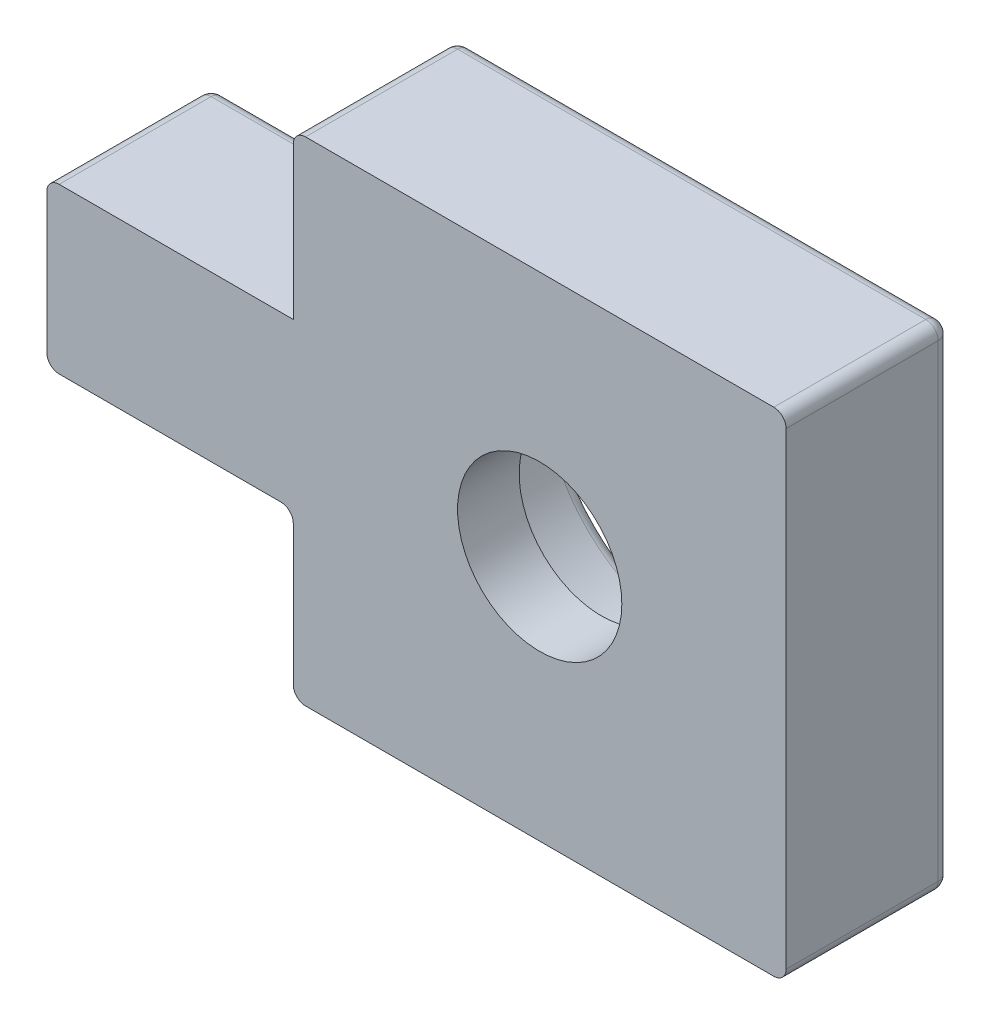
ISO-10303-21;
HEADER;
FILE_DESCRIPTION(('STEP AP214'),'2;1');
FILE_NAME('part.step','',(''),(''),'','','');
FILE_SCHEMA(('AUTOMOTIVE_DESIGN { 1 0 10303 214 1 1 1 1 }'));
ENDSEC;
DATA;
#1=APPLICATION_CONTEXT('core data for automotive mechanical design processes');
#2=APPLICATION_PROTOCOL_DEFINITION('international standard','automotive_design',2000,#1);
#3=PRODUCT_CONTEXT('',#1,'mechanical');
#4=PRODUCT('Part','Part','',(#3));
#5=PRODUCT_RELATED_PRODUCT_CATEGORY('part','',(#4));
#6=PRODUCT_DEFINITION_FORMATION('','',#4);
#7=PRODUCT_DEFINITION_CONTEXT('part definition',#1,'design');
#8=PRODUCT_DEFINITION('design','',#6,#7);
#9=PRODUCT_DEFINITION_SHAPE('','',#8);
#10=(LENGTH_UNIT() NAMED_UNIT(*) SI_UNIT(.MILLI.,.METRE.));
#11=(NAMED_UNIT(*) PLANE_ANGLE_UNIT() SI_UNIT($,.RADIAN.));
#12=(NAMED_UNIT(*) SI_UNIT($,.STERADIAN.) SOLID_ANGLE_UNIT());
#13=UNCERTAINTY_MEASURE_WITH_UNIT(LENGTH_MEASURE(1.E-05),#10,'distance_accuracy_value','');
#14=(GEOMETRIC_REPRESENTATION_CONTEXT(3) GLOBAL_UNCERTAINTY_ASSIGNED_CONTEXT((#13)) GLOBAL_UNIT_ASSIGNED_CONTEXT((#10,
#11,#12)) REPRESENTATION_CONTEXT('',''));
#15=CARTESIAN_POINT('',(0.,0.,0.));
#16=DIRECTION('',(0.,0.,1.));
#17=DIRECTION('',(1.,0.,0.));
#18=AXIS2_PLACEMENT_3D('',#15,#16,#17);
#19=CARTESIAN_POINT('',(0.,0.,4.));
#20=DIRECTION('',(1.,0.,0.));
#21=DIRECTION('',(0.,0.,-1.));
#22=AXIS2_PLACEMENT_3D('',#19,#20,#21);
#23=PLANE('',#22);
#24=DIRECTION('',(0.,0.,-1.));
#25=VECTOR('',#24,1.);
#26=CARTESIAN_POINT('',(0.,11.7,4.));
#27=LINE('',#26,#25);
#28=CARTESIAN_POINT('',(0.,11.7,4.));
#29=VERTEX_POINT('',#28);
#30=CARTESIAN_POINT('',(0.,11.7,0.3));
#31=VERTEX_POINT('',#30);
#32=EDGE_CURVE('E57',#29,#31,#27,.T.);
#33=ORIENTED_EDGE('',*,*,#32,.T.);
#34=DIRECTION('',(0.,-1.,0.));
#35=VECTOR('',#34,1.);
#36=CARTESIAN_POINT('',(0.,8.,0.3));
#37=LINE('',#36,#35);
#38=CARTESIAN_POINT('',(0.,8.,0.3));
#39=VERTEX_POINT('',#38);
#40=EDGE_CURVE('E196',#31,#39,#37,.T.);
#41=ORIENTED_EDGE('',*,*,#40,.T.);
#42=DIRECTION('',(0.,0.,-1.));
#43=VECTOR('',#42,1.);
#44=CARTESIAN_POINT('',(0.,8.,4.));
#45=LINE('',#44,#43);
#46=CARTESIAN_POINT('',(0.,8.,4.));
#47=VERTEX_POINT('',#46);
#48=EDGE_CURVE('E188',#47,#39,#45,.T.);
#49=ORIENTED_EDGE('',*,*,#48,.F.);
#50=DIRECTION('',(0.,-1.,0.));
#51=VECTOR('',#50,1.);
#52=CARTESIAN_POINT('',(0.,0.,4.));
#53=LINE('',#52,#51);
#54=EDGE_CURVE('E174',#29,#47,#53,.T.);
#55=ORIENTED_EDGE('',*,*,#54,.F.);
#56=EDGE_LOOP('',(#33,#41,#49,#55));
#57=FACE_BOUND('',#56,.T.);
#58=ADVANCED_FACE('F39',(#57),#23,.F.);
#59=CARTESIAN_POINT('',(0.,3.7,4.));
#60=VERTEX_POINT('',#59);
#61=CARTESIAN_POINT('',(0.,0.3,4.));
#62=VERTEX_POINT('',#61);
#63=EDGE_CURVE('E182',#60,#62,#53,.T.);
#64=ORIENTED_EDGE('',*,*,#63,.F.);
#65=DIRECTION('',(0.,0.,-1.));
#66=VECTOR('',#65,1.);
#67=CARTESIAN_POINT('',(0.,3.7,0.));
#68=LINE('',#67,#66);
#69=CARTESIAN_POINT('',(0.,3.7,0.3));
#70=VERTEX_POINT('',#69);
#71=EDGE_CURVE('E301',#60,#70,#68,.T.);
#72=ORIENTED_EDGE('',*,*,#71,.T.);
#73=DIRECTION('',(0.,-1.,0.));
#74=VECTOR('',#73,1.);
#75=CARTESIAN_POINT('',(0.,0.,0.3));
#76=LINE('',#75,#74);
#77=CARTESIAN_POINT('',(0.,0.3,0.3));
#78=VERTEX_POINT('',#77);
#79=EDGE_CURVE('E298',#70,#78,#76,.T.);
#80=ORIENTED_EDGE('',*,*,#79,.T.);
#81=DIRECTION('',(0.,0.,-1.));
#82=VECTOR('',#81,1.);
#83=CARTESIAN_POINT('',(0.,0.3,4.));
#84=LINE('',#83,#82);
#85=EDGE_CURVE('E295',#78,#62,#84,.F.);
#86=ORIENTED_EDGE('',*,*,#85,.T.);
#87=EDGE_LOOP('',(#64,#72,#80,#86));
#88=FACE_BOUND('',#87,.T.);
#89=ADVANCED_FACE('F562',(#88),#23,.F.);
#90=CARTESIAN_POINT('',(0.,0.,4.));
#91=DIRECTION('',(0.,1.,0.));
#92=DIRECTION('',(0.,0.,1.));
#93=AXIS2_PLACEMENT_3D('',#90,#91,#92);
#94=PLANE('',#93);
#95=DIRECTION('',(1.,0.,0.));
#96=VECTOR('',#95,1.);
#97=CARTESIAN_POINT('',(12.,0.,0.3));
#98=LINE('',#97,#96);
#99=CARTESIAN_POINT('',(0.3,0.,0.3));
#100=VERTEX_POINT('',#99);
#101=CARTESIAN_POINT('',(11.7,0.,0.3));
#102=VERTEX_POINT('',#101);
#103=EDGE_CURVE('E307',#100,#102,#98,.T.);
#104=ORIENTED_EDGE('',*,*,#103,.T.);
#105=DIRECTION('',(0.,0.,-1.));
#106=VECTOR('',#105,1.);
#107=CARTESIAN_POINT('',(11.7,0.,4.));
#108=LINE('',#107,#106);
#109=CARTESIAN_POINT('',(11.7,0.,4.));
#110=VERTEX_POINT('',#109);
#111=EDGE_CURVE('E310',#102,#110,#108,.F.);
#112=ORIENTED_EDGE('',*,*,#111,.T.);
#113=DIRECTION('',(1.,0.,0.));
#114=VECTOR('',#113,1.);
#115=CARTESIAN_POINT('',(0.,0.,4.));
#116=LINE('',#115,#114);
#117=CARTESIAN_POINT('',(0.3,0.,4.));
#118=VERTEX_POINT('',#117);
#119=EDGE_CURVE('E181',#118,#110,#116,.T.);
#120=ORIENTED_EDGE('',*,*,#119,.F.);
#121=DIRECTION('',(0.,0.,-1.));
#122=VECTOR('',#121,1.);
#123=CARTESIAN_POINT('',(0.3,0.,4.));
#124=LINE('',#123,#122);
#125=EDGE_CURVE('E304',#118,#100,#124,.T.);
#126=ORIENTED_EDGE('',*,*,#125,.T.);
#127=EDGE_LOOP('',(#104,#112,#120,#126));
#128=FACE_BOUND('',#127,.T.);
#129=ADVANCED_FACE('F467',(#128),#94,.F.);
#130=CARTESIAN_POINT('',(12.,0.,4.));
#131=DIRECTION('',(-1.,0.,0.));
#132=DIRECTION('',(0.,0.,1.));
#133=AXIS2_PLACEMENT_3D('',#130,#131,#132);
#134=PLANE('',#133);
#135=DIRECTION('',(0.,1.,0.));
#136=VECTOR('',#135,1.);
#137=CARTESIAN_POINT('',(12.,12.,0.3));
#138=LINE('',#137,#136);
#139=CARTESIAN_POINT('',(12.,0.3,0.3));
#140=VERTEX_POINT('',#139);
#141=CARTESIAN_POINT('',(12.,11.7,0.3));
#142=VERTEX_POINT('',#141);
#143=EDGE_CURVE('E316',#140,#142,#138,.T.);
#144=ORIENTED_EDGE('',*,*,#143,.T.);
#145=DIRECTION('',(0.,0.,-1.));
#146=VECTOR('',#145,1.);
#147=CARTESIAN_POINT('',(12.,11.7,4.));
#148=LINE('',#147,#146);
#149=CARTESIAN_POINT('',(12.,11.7,4.));
#150=VERTEX_POINT('',#149);
#151=EDGE_CURVE('E319',#142,#150,#148,.F.);
#152=ORIENTED_EDGE('',*,*,#151,.T.);
#153=DIRECTION('',(0.,1.,0.));
#154=VECTOR('',#153,1.);
#155=CARTESIAN_POINT('',(12.,0.,4.));
#156=LINE('',#155,#154);
#157=CARTESIAN_POINT('',(12.,0.3,4.));
#158=VERTEX_POINT('',#157);
#159=EDGE_CURVE('E217',#158,#150,#156,.T.);
#160=ORIENTED_EDGE('',*,*,#159,.F.);
#161=DIRECTION('',(0.,0.,-1.));
#162=VECTOR('',#161,1.);
#163=CARTESIAN_POINT('',(12.,0.3,4.));
#164=LINE('',#163,#162);
#165=EDGE_CURVE('E313',#158,#140,#164,.T.);
#166=ORIENTED_EDGE('',*,*,#165,.T.);
#167=EDGE_LOOP('',(#144,#152,#160,#166));
#168=FACE_BOUND('',#167,.T.);
#169=ADVANCED_FACE('F478',(#168),#134,.F.);
#170=CARTESIAN_POINT('',(0.,12.,4.));
#171=DIRECTION('',(0.,-1.,0.));
#172=DIRECTION('',(0.,0.,-1.));
#173=AXIS2_PLACEMENT_3D('',#170,#171,#172);
#174=PLANE('',#173);
#175=DIRECTION('',(-1.,0.,0.));
#176=VECTOR('',#175,1.);
#177=CARTESIAN_POINT('',(0.,12.,0.3));
#178=LINE('',#177,#176);
#179=CARTESIAN_POINT('',(11.7,12.,0.3));
#180=VERTEX_POINT('',#179);
#181=CARTESIAN_POINT('',(0.3,12.,0.3));
#182=VERTEX_POINT('',#181);
#183=EDGE_CURVE('E325',#180,#182,#178,.T.);
#184=ORIENTED_EDGE('',*,*,#183,.T.);
#185=DIRECTION('',(0.,0.,-1.));
#186=VECTOR('',#185,1.);
#187=CARTESIAN_POINT('',(0.3,12.,4.));
#188=LINE('',#187,#186);
#189=CARTESIAN_POINT('',(0.3,12.,4.));
#190=VERTEX_POINT('',#189);
#191=EDGE_CURVE('E328',#182,#190,#188,.F.);
#192=ORIENTED_EDGE('',*,*,#191,.T.);
#193=DIRECTION('',(-1.,0.,0.));
#194=VECTOR('',#193,1.);
#195=CARTESIAN_POINT('',(0.,12.,4.));
#196=LINE('',#195,#194);
#197=CARTESIAN_POINT('',(11.7,12.,4.));
#198=VERTEX_POINT('',#197);
#199=EDGE_CURVE('E221',#198,#190,#196,.T.);
#200=ORIENTED_EDGE('',*,*,#199,.F.);
#201=DIRECTION('',(0.,0.,-1.));
#202=VECTOR('',#201,1.);
#203=CARTESIAN_POINT('',(11.7,12.,4.));
#204=LINE('',#203,#202);
#205=EDGE_CURVE('E322',#198,#180,#204,.T.);
#206=ORIENTED_EDGE('',*,*,#205,.T.);
#207=EDGE_LOOP('',(#184,#192,#200,#206));
#208=FACE_BOUND('',#207,.T.);
#209=ADVANCED_FACE('F498',(#208),#174,.F.);
#210=CARTESIAN_POINT('',(0.,0.,4.));
#211=DIRECTION('',(0.,0.,-1.));
#212=DIRECTION('',(-1.,0.,0.));
#213=AXIS2_PLACEMENT_3D('',#210,#211,#212);
#214=PLANE('',#213);
#215=CARTESIAN_POINT('',(6.,6.,4.));
#216=DIRECTION('',(0.,0.,1.));
#217=DIRECTION('',(1.,0.,0.));
#218=AXIS2_PLACEMENT_3D('',#215,#216,#217);
#219=CIRCLE('',#218,2.);
#220=CARTESIAN_POINT('',(8.,6.,4.));
#221=VERTEX_POINT('',#220);
#222=EDGE_CURVE('E210',#221,#221,#219,.T.);
#223=ORIENTED_EDGE('',*,*,#222,.F.);
#224=EDGE_LOOP('',(#223));
#225=FACE_BOUND('',#224,.T.);
#226=DIRECTION('',(-1.,0.,0.));
#227=VECTOR('',#226,1.);
#228=CARTESIAN_POINT('',(0.,8.,4.));
#229=LINE('',#228,#227);
#230=CARTESIAN_POINT('',(-5.7,8.,4.));
#231=VERTEX_POINT('',#230);
#232=EDGE_CURVE('E177',#47,#231,#229,.T.);
#233=ORIENTED_EDGE('',*,*,#232,.T.);
#234=CARTESIAN_POINT('',(-5.7,7.7,4.));
#235=DIRECTION('',(0.,0.,-1.));
#236=DIRECTION('',(-1.,0.,0.));
#237=AXIS2_PLACEMENT_3D('',#234,#235,#236);
#238=CIRCLE('',#237,0.3);
#239=CARTESIAN_POINT('',(-6.,7.7,4.));
#240=VERTEX_POINT('',#239);
#241=EDGE_CURVE('E49',#231,#240,#238,.F.);
#242=ORIENTED_EDGE('',*,*,#241,.T.);
#243=DIRECTION('',(0.,-1.,0.));
#244=VECTOR('',#243,1.);
#245=CARTESIAN_POINT('',(-6.,8.,4.));
#246=LINE('',#245,#244);
#247=CARTESIAN_POINT('',(-6.,4.3,4.));
#248=VERTEX_POINT('',#247);
#249=EDGE_CURVE('E193',#240,#248,#246,.T.);
#250=ORIENTED_EDGE('',*,*,#249,.T.);
#251=CARTESIAN_POINT('',(-5.7,4.3,4.));
#252=DIRECTION('',(0.,0.,-1.));
#253=DIRECTION('',(-1.,0.,0.));
#254=AXIS2_PLACEMENT_3D('',#251,#252,#253);
#255=CIRCLE('',#254,0.3);
#256=CARTESIAN_POINT('',(-5.7,4.,4.));
#257=VERTEX_POINT('',#256);
#258=EDGE_CURVE('E346',#248,#257,#255,.F.);
#259=ORIENTED_EDGE('',*,*,#258,.T.);
#260=DIRECTION('',(1.,0.,0.));
#261=VECTOR('',#260,1.);
#262=CARTESIAN_POINT('',(0.,4.,4.));
#263=LINE('',#262,#261);
#264=CARTESIAN_POINT('',(-0.3,4.,4.));
#265=VERTEX_POINT('',#264);
#266=EDGE_CURVE('E199',#257,#265,#263,.T.);
#267=ORIENTED_EDGE('',*,*,#266,.T.);
#268=CARTESIAN_POINT('',(-0.3,3.7,4.));
#269=DIRECTION('',(0.,0.,-1.));
#270=DIRECTION('',(-1.,0.,0.));
#271=AXIS2_PLACEMENT_3D('',#268,#269,#270);
#272=CIRCLE('',#271,0.3);
#273=EDGE_CURVE('E11',#265,#60,#272,.T.);
#274=ORIENTED_EDGE('',*,*,#273,.T.);
#275=ORIENTED_EDGE('',*,*,#63,.T.);
#276=CARTESIAN_POINT('',(0.3,0.3,4.));
#277=DIRECTION('',(0.,0.,-1.));
#278=DIRECTION('',(-1.,0.,0.));
#279=AXIS2_PLACEMENT_3D('',#276,#277,#278);
#280=CIRCLE('',#279,0.3);
#281=EDGE_CURVE('E343',#62,#118,#280,.F.);
#282=ORIENTED_EDGE('',*,*,#281,.T.);
#283=ORIENTED_EDGE('',*,*,#119,.T.);
#284=CARTESIAN_POINT('',(11.7,0.3,4.));
#285=DIRECTION('',(0.,0.,-1.));
#286=DIRECTION('',(-1.,0.,0.));
#287=AXIS2_PLACEMENT_3D('',#284,#285,#286);
#288=CIRCLE('',#287,0.3);
#289=EDGE_CURVE('E349',#110,#158,#288,.F.);
#290=ORIENTED_EDGE('',*,*,#289,.T.);
#291=ORIENTED_EDGE('',*,*,#159,.T.);
#292=CARTESIAN_POINT('',(11.7,11.7,4.));
#293=DIRECTION('',(0.,0.,-1.));
#294=DIRECTION('',(-1.,0.,0.));
#295=AXIS2_PLACEMENT_3D('',#292,#293,#294);
#296=CIRCLE('',#295,0.3);
#297=EDGE_CURVE('E352',#150,#198,#296,.F.);
#298=ORIENTED_EDGE('',*,*,#297,.T.);
#299=ORIENTED_EDGE('',*,*,#199,.T.);
#300=CARTESIAN_POINT('',(0.3,11.7,4.));
#301=DIRECTION('',(0.,0.,-1.));
#302=DIRECTION('',(-1.,0.,0.));
#303=AXIS2_PLACEMENT_3D('',#300,#301,#302);
#304=CIRCLE('',#303,0.3);
#305=EDGE_CURVE('E65',#190,#29,#304,.F.);
#306=ORIENTED_EDGE('',*,*,#305,.T.);
#307=ORIENTED_EDGE('',*,*,#54,.T.);
#308=EDGE_LOOP('',(#233,#242,#250,#259,#267,#274,#275,#282,#283,#290,#291,#298,#299,#306,#307));
#309=FACE_BOUND('',#308,.T.);
#310=ADVANCED_FACE('F176',(#225,#309),#214,.F.);
#311=CARTESIAN_POINT('',(0.,0.,0.));
#312=DIRECTION('',(0.,0.,-1.));
#313=DIRECTION('',(-1.,0.,0.));
#314=AXIS2_PLACEMENT_3D('',#311,#312,#313);
#315=PLANE('',#314);
#316=DIRECTION('',(1.,0.,0.));
#317=VECTOR('',#316,1.);
#318=CARTESIAN_POINT('',(-6.,4.3,0.));
#319=LINE('',#318,#317);
#320=CARTESIAN_POINT('',(-0.3,4.3,0.));
#321=VERTEX_POINT('',#320);
#322=CARTESIAN_POINT('',(-5.7,4.3,0.));
#323=VERTEX_POINT('',#322);
#324=EDGE_CURVE('E271',#321,#323,#319,.F.);
#325=ORIENTED_EDGE('',*,*,#324,.T.);
#326=DIRECTION('',(0.,-1.,0.));
#327=VECTOR('',#326,1.);
#328=CARTESIAN_POINT('',(-5.7,8.,0.));
#329=LINE('',#328,#327);
#330=CARTESIAN_POINT('',(-5.7,7.7,0.));
#331=VERTEX_POINT('',#330);
#332=EDGE_CURVE('E274',#323,#331,#329,.F.);
#333=ORIENTED_EDGE('',*,*,#332,.T.);
#334=DIRECTION('',(-1.,0.,0.));
#335=VECTOR('',#334,1.);
#336=CARTESIAN_POINT('',(0.,7.7,0.));
#337=LINE('',#336,#335);
#338=CARTESIAN_POINT('',(0.3,7.7,0.));
#339=VERTEX_POINT('',#338);
#340=EDGE_CURVE('E263',#331,#339,#337,.F.);
#341=ORIENTED_EDGE('',*,*,#340,.T.);
#342=DIRECTION('',(0.,-1.,0.));
#343=VECTOR('',#342,1.);
#344=CARTESIAN_POINT('',(0.3,12.,0.));
#345=LINE('',#344,#343);
#346=CARTESIAN_POINT('',(0.3,11.7,0.));
#347=VERTEX_POINT('',#346);
#348=EDGE_CURVE('E248',#339,#347,#345,.F.);
#349=ORIENTED_EDGE('',*,*,#348,.T.);
#350=DIRECTION('',(-1.,0.,0.));
#351=VECTOR('',#350,1.);
#352=CARTESIAN_POINT('',(12.,11.7,0.));
#353=LINE('',#352,#351);
#354=CARTESIAN_POINT('',(11.7,11.7,0.));
#355=VERTEX_POINT('',#354);
#356=EDGE_CURVE('E251',#347,#355,#353,.F.);
#357=ORIENTED_EDGE('',*,*,#356,.T.);
#358=DIRECTION('',(0.,1.,0.));
#359=VECTOR('',#358,1.);
#360=CARTESIAN_POINT('',(11.7,0.,0.));
#361=LINE('',#360,#359);
#362=CARTESIAN_POINT('',(11.7,0.3,0.));
#363=VERTEX_POINT('',#362);
#364=EDGE_CURVE('E254',#355,#363,#361,.F.);
#365=ORIENTED_EDGE('',*,*,#364,.T.);
#366=DIRECTION('',(1.,0.,0.));
#367=VECTOR('',#366,1.);
#368=CARTESIAN_POINT('',(0.,0.3,0.));
#369=LINE('',#368,#367);
#370=CARTESIAN_POINT('',(0.3,0.3,0.));
#371=VERTEX_POINT('',#370);
#372=EDGE_CURVE('E257',#363,#371,#369,.F.);
#373=ORIENTED_EDGE('',*,*,#372,.T.);
#374=DIRECTION('',(0.,-1.,0.));
#375=VECTOR('',#374,1.);
#376=CARTESIAN_POINT('',(0.3,4.,0.));
#377=LINE('',#376,#375);
#378=CARTESIAN_POINT('',(0.3,3.7,0.));
#379=VERTEX_POINT('',#378);
#380=EDGE_CURVE('E260',#371,#379,#377,.F.);
#381=ORIENTED_EDGE('',*,*,#380,.T.);
#382=CARTESIAN_POINT('',(-0.3,3.7,0.));
#383=DIRECTION('',(0.,0.,-1.));
#384=DIRECTION('',(-1.,0.,0.));
#385=AXIS2_PLACEMENT_3D('',#382,#383,#384);
#386=CIRCLE('',#385,0.6);
#387=EDGE_CURVE('E267',#321,#379,#386,.T.);
#388=ORIENTED_EDGE('',*,*,#387,.F.);
#389=EDGE_LOOP('',(#325,#333,#341,#349,#357,#365,#373,#381,#388));
#390=FACE_BOUND('',#389,.T.);
#391=CARTESIAN_POINT('',(6.,6.,0.));
#392=DIRECTION('',(0.,0.,-1.));
#393=DIRECTION('',(-1.,0.,0.));
#394=AXIS2_PLACEMENT_3D('',#391,#392,#393);
#395=CIRCLE('',#394,3.9);
#396=CARTESIAN_POINT('',(2.1,6.,0.));
#397=VERTEX_POINT('',#396);
#398=EDGE_CURVE('E244',#397,#397,#395,.F.);
#399=ORIENTED_EDGE('',*,*,#398,.T.);
#400=EDGE_LOOP('',(#399));
#401=FACE_BOUND('',#400,.T.);
#402=CARTESIAN_POINT('',(-4.,6.,0.));
#403=DIRECTION('',(0.,0.,-1.));
#404=DIRECTION('',(-1.,0.,0.));
#405=AXIS2_PLACEMENT_3D('',#402,#403,#404);
#406=CIRCLE('',#405,1.53970663244212);
#407=CARTESIAN_POINT('',(-5.53970663244212,6.,0.));
#408=VERTEX_POINT('',#407);
#409=EDGE_CURVE('E240',#408,#408,#406,.F.);
#410=ORIENTED_EDGE('',*,*,#409,.T.);
#411=EDGE_LOOP('',(#410));
#412=FACE_BOUND('',#411,.T.);
#413=ADVANCED_FACE('F456',(#390,#401,#412),#315,.T.);
#414=CARTESIAN_POINT('',(6.,6.,4.));
#415=DIRECTION('',(0.,0.,-1.));
#416=DIRECTION('',(-1.,0.,0.));
#417=AXIS2_PLACEMENT_3D('',#414,#415,#416);
#418=CYLINDRICAL_SURFACE('',#417,2.);
#419=CARTESIAN_POINT('',(6.,6.,2.5));
#420=DIRECTION('',(0.,0.,1.));
#421=DIRECTION('',(1.,0.,0.));
#422=AXIS2_PLACEMENT_3D('',#419,#420,#421);
#423=CIRCLE('',#422,2.);
#424=CARTESIAN_POINT('',(8.,6.,2.5));
#425=VERTEX_POINT('',#424);
#426=EDGE_CURVE('E204',#425,#425,#423,.T.);
#427=ORIENTED_EDGE('',*,*,#426,.F.);
#428=EDGE_LOOP('',(#427));
#429=FACE_BOUND('',#428,.T.);
#430=ORIENTED_EDGE('',*,*,#222,.T.);
#431=EDGE_LOOP('',(#430));
#432=FACE_BOUND('',#431,.T.);
#433=ADVANCED_FACE('F807',(#429,#432),#418,.F.);
#434=CARTESIAN_POINT('',(6.,6.,2.5));
#435=DIRECTION('',(0.,0.,-1.));
#436=DIRECTION('',(-1.,0.,0.));
#437=AXIS2_PLACEMENT_3D('',#434,#435,#436);
#438=CYLINDRICAL_SURFACE('',#437,3.6);
#439=CARTESIAN_POINT('',(6.,6.,0.3));
#440=DIRECTION('',(0.,0.,-1.));
#441=DIRECTION('',(-1.,0.,0.));
#442=AXIS2_PLACEMENT_3D('',#439,#440,#441);
#443=CIRCLE('',#442,3.6);
#444=CARTESIAN_POINT('',(2.4,6.,0.3));
#445=VERTEX_POINT('',#444);
#446=EDGE_CURVE('E335',#445,#445,#443,.T.);
#447=ORIENTED_EDGE('',*,*,#446,.T.);
#448=EDGE_LOOP('',(#447));
#449=FACE_BOUND('',#448,.T.);
#450=CARTESIAN_POINT('',(6.,6.,2.5));
#451=DIRECTION('',(0.,0.,1.));
#452=DIRECTION('',(1.,0.,0.));
#453=AXIS2_PLACEMENT_3D('',#450,#451,#452);
#454=CIRCLE('',#453,3.6);
#455=CARTESIAN_POINT('',(9.6,6.,2.5));
#456=VERTEX_POINT('',#455);
#457=EDGE_CURVE('E198',#456,#456,#454,.T.);
#458=ORIENTED_EDGE('',*,*,#457,.T.);
#459=EDGE_LOOP('',(#458));
#460=FACE_BOUND('',#459,.T.);
#461=ADVANCED_FACE('F835',(#449,#460),#438,.F.);
#462=CARTESIAN_POINT('',(6.,6.,2.5));
#463=DIRECTION('',(0.,0.,1.));
#464=DIRECTION('',(1.,0.,0.));
#465=AXIS2_PLACEMENT_3D('',#462,#463,#464);
#466=PLANE('',#465);
#467=ORIENTED_EDGE('',*,*,#426,.T.);
#468=EDGE_LOOP('',(#467));
#469=FACE_BOUND('',#468,.T.);
#470=ORIENTED_EDGE('',*,*,#457,.F.);
#471=EDGE_LOOP('',(#470));
#472=FACE_BOUND('',#471,.T.);
#473=ADVANCED_FACE('F797',(#469,#472),#466,.F.);
#474=CARTESIAN_POINT('',(0.,8.,4.));
#475=DIRECTION('',(0.,-1.,0.));
#476=DIRECTION('',(0.,0.,-1.));
#477=AXIS2_PLACEMENT_3D('',#474,#475,#476);
#478=PLANE('',#477);
#479=ORIENTED_EDGE('',*,*,#48,.T.);
#480=DIRECTION('',(-1.,0.,0.));
#481=VECTOR('',#480,1.);
#482=CARTESIAN_POINT('',(-6.,8.,0.3));
#483=LINE('',#482,#481);
#484=CARTESIAN_POINT('',(-5.7,8.,0.3));
#485=VERTEX_POINT('',#484);
#486=EDGE_CURVE('E237',#39,#485,#483,.T.);
#487=ORIENTED_EDGE('',*,*,#486,.T.);
#488=DIRECTION('',(0.,0.,-1.));
#489=VECTOR('',#488,1.);
#490=CARTESIAN_POINT('',(-5.7,8.,4.));
#491=LINE('',#490,#489);
#492=EDGE_CURVE('E191',#485,#231,#491,.F.);
#493=ORIENTED_EDGE('',*,*,#492,.T.);
#494=ORIENTED_EDGE('',*,*,#232,.F.);
#495=EDGE_LOOP('',(#479,#487,#493,#494));
#496=FACE_BOUND('',#495,.T.);
#497=ADVANCED_FACE('F186',(#496),#478,.F.);
#498=CARTESIAN_POINT('',(-6.,8.,4.));
#499=DIRECTION('',(1.,0.,0.));
#500=DIRECTION('',(0.,1.,0.));
#501=AXIS2_PLACEMENT_3D('',#498,#499,#500);
#502=PLANE('',#501);
#503=ORIENTED_EDGE('',*,*,#249,.F.);
#504=DIRECTION('',(0.,0.,-1.));
#505=VECTOR('',#504,1.);
#506=CARTESIAN_POINT('',(-6.,7.7,4.));
#507=LINE('',#506,#505);
#508=CARTESIAN_POINT('',(-6.,7.7,0.3));
#509=VERTEX_POINT('',#508);
#510=EDGE_CURVE('E283',#240,#509,#507,.T.);
#511=ORIENTED_EDGE('',*,*,#510,.T.);
#512=DIRECTION('',(0.,-1.,0.));
#513=VECTOR('',#512,1.);
#514=CARTESIAN_POINT('',(-6.,4.,0.3));
#515=LINE('',#514,#513);
#516=CARTESIAN_POINT('',(-6.,4.3,0.3));
#517=VERTEX_POINT('',#516);
#518=EDGE_CURVE('E280',#509,#517,#515,.T.);
#519=ORIENTED_EDGE('',*,*,#518,.T.);
#520=DIRECTION('',(0.,0.,-1.));
#521=VECTOR('',#520,1.);
#522=CARTESIAN_POINT('',(-6.,4.3,4.));
#523=LINE('',#522,#521);
#524=EDGE_CURVE('E277',#517,#248,#523,.F.);
#525=ORIENTED_EDGE('',*,*,#524,.T.);
#526=EDGE_LOOP('',(#503,#511,#519,#525));
#527=FACE_BOUND('',#526,.T.);
#528=ADVANCED_FACE('F524',(#527),#502,.F.);
#529=CARTESIAN_POINT('',(0.,4.,4.));
#530=DIRECTION('',(0.,1.,0.));
#531=DIRECTION('',(-1.,0.,0.));
#532=AXIS2_PLACEMENT_3D('',#529,#530,#531);
#533=PLANE('',#532);
#534=ORIENTED_EDGE('',*,*,#266,.F.);
#535=DIRECTION('',(0.,0.,-1.));
#536=VECTOR('',#535,1.);
#537=CARTESIAN_POINT('',(-5.7,4.,4.));
#538=LINE('',#537,#536);
#539=CARTESIAN_POINT('',(-5.7,4.,0.3));
#540=VERTEX_POINT('',#539);
#541=EDGE_CURVE('E292',#257,#540,#538,.T.);
#542=ORIENTED_EDGE('',*,*,#541,.T.);
#543=DIRECTION('',(1.,0.,0.));
#544=VECTOR('',#543,1.);
#545=CARTESIAN_POINT('',(0.,4.,0.3));
#546=LINE('',#545,#544);
#547=CARTESIAN_POINT('',(-0.3,4.,0.3));
#548=VERTEX_POINT('',#547);
#549=EDGE_CURVE('E289',#540,#548,#546,.T.);
#550=ORIENTED_EDGE('',*,*,#549,.T.);
#551=DIRECTION('',(0.,0.,-1.));
#552=VECTOR('',#551,1.);
#553=CARTESIAN_POINT('',(-0.3,4.,4.));
#554=LINE('',#553,#552);
#555=EDGE_CURVE('E286',#548,#265,#554,.F.);
#556=ORIENTED_EDGE('',*,*,#555,.T.);
#557=EDGE_LOOP('',(#534,#542,#550,#556));
#558=FACE_BOUND('',#557,.T.);
#559=ADVANCED_FACE('F546',(#558),#533,.F.);
#560=CARTESIAN_POINT('',(-4.,6.,0.));
#561=DIRECTION('',(0.,0.,1.));
#562=DIRECTION('',(1.,0.,0.));
#563=AXIS2_PLACEMENT_3D('',#560,#561,#562);
#564=CONICAL_SURFACE('',#563,1.25,0.0349065850398866);
#565=CARTESIAN_POINT('',(-4.,6.,-0.28953015098925));
#566=DIRECTION('',(0.,0.,1.));
#567=DIRECTION('',(1.,0.,0.));
#568=AXIS2_PLACEMENT_3D('',#565,#566,#567);
#569=CIRCLE('',#568,1.23988938433639);
#570=CARTESIAN_POINT('',(-2.76011061566361,6.,-0.28953015098925));
#571=VERTEX_POINT('',#570);
#572=EDGE_CURVE('E339',#571,#571,#569,.F.);
#573=ORIENTED_EDGE('',*,*,#572,.T.);
#574=EDGE_LOOP('',(#573));
#575=FACE_BOUND('',#574,.T.);
#576=CARTESIAN_POINT('',(-4.,6.,-3.48190782249384));
#577=DIRECTION('',(0.,0.,1.));
#578=DIRECTION('',(1.,0.,0.));
#579=AXIS2_PLACEMENT_3D('',#576,#577,#578);
#580=CIRCLE('',#579,1.12840909953918);
#581=CARTESIAN_POINT('',(-2.87159090046082,6.,-3.48190782249384));
#582=VERTEX_POINT('',#581);
#583=EDGE_CURVE('E224',#582,#582,#580,.T.);
#584=ORIENTED_EDGE('',*,*,#583,.T.);
#585=EDGE_LOOP('',(#584));
#586=FACE_BOUND('',#585,.T.);
#587=ADVANCED_FACE('F766',(#575,#586),#564,.T.);
#588=CARTESIAN_POINT('',(-4.,6.,-4.));
#589=DIRECTION('',(0.,0.,1.));
#590=DIRECTION('',(1.,0.,0.));
#591=AXIS2_PLACEMENT_3D('',#588,#589,#590);
#592=PLANE('',#591);
#593=CARTESIAN_POINT('',(-4.,6.,-4.));
#594=DIRECTION('',(0.,0.,1.));
#595=DIRECTION('',(1.,0.,0.));
#596=AXIS2_PLACEMENT_3D('',#593,#594,#595);
#597=CIRCLE('',#596,0.610316922033022);
#598=CARTESIAN_POINT('',(-3.38968307796698,6.,-4.));
#599=VERTEX_POINT('',#598);
#600=EDGE_CURVE('E231',#599,#599,#597,.F.);
#601=ORIENTED_EDGE('',*,*,#600,.T.);
#602=EDGE_LOOP('',(#601));
#603=FACE_BOUND('',#602,.T.);
#604=ADVANCED_FACE('F575',(#603),#592,.F.);
#605=CARTESIAN_POINT('',(-4.,6.,-3.48190782249384));
#606=DIRECTION('',(0.,0.,1.));
#607=DIRECTION('',(1.,0.,0.));
#608=AXIS2_PLACEMENT_3D('',#605,#606,#607);
#609=CONICAL_SURFACE('',#608,1.12840909953918,0.785398163397451);
#610=ORIENTED_EDGE('',*,*,#600,.F.);
#611=EDGE_LOOP('',(#610));
#612=FACE_BOUND('',#611,.T.);
#613=ORIENTED_EDGE('',*,*,#583,.F.);
#614=EDGE_LOOP('',(#613));
#615=FACE_BOUND('',#614,.T.);
#616=ADVANCED_FACE('F571',(#612,#615),#609,.T.);
#617=CARTESIAN_POINT('',(0.3,0.3,4.));
#618=DIRECTION('',(0.,0.,-1.));
#619=DIRECTION('',(-1.,0.,0.));
#620=AXIS2_PLACEMENT_3D('',#617,#618,#619);
#621=CYLINDRICAL_SURFACE('',#620,0.3);
#622=ORIENTED_EDGE('',*,*,#281,.F.);
#623=ORIENTED_EDGE('',*,*,#85,.F.);
#624=CARTESIAN_POINT('',(0.3,0.3,0.3));
#625=DIRECTION('',(0.,0.,-1.));
#626=DIRECTION('',(-1.,0.,0.));
#627=AXIS2_PLACEMENT_3D('',#624,#625,#626);
#628=CIRCLE('',#627,0.3);
#629=EDGE_CURVE('E43',#100,#78,#628,.T.);
#630=ORIENTED_EDGE('',*,*,#629,.F.);
#631=ORIENTED_EDGE('',*,*,#125,.F.);
#632=EDGE_LOOP('',(#622,#623,#630,#631));
#633=FACE_BOUND('',#632,.T.);
#634=ADVANCED_FACE('F574',(#633),#621,.T.);
#635=CARTESIAN_POINT('',(0.,0.3,0.3));
#636=DIRECTION('',(-1.,0.,0.));
#637=DIRECTION('',(0.,0.,1.));
#638=AXIS2_PLACEMENT_3D('',#635,#636,#637);
#639=CYLINDRICAL_SURFACE('',#638,0.3);
#640=CARTESIAN_POINT('',(11.7,0.3,0.3));
#641=DIRECTION('',(1.,0.,0.));
#642=DIRECTION('',(0.,0.,-1.));
#643=AXIS2_PLACEMENT_3D('',#640,#641,#642);
#644=CIRCLE('',#643,0.3);
#645=EDGE_CURVE('E433',#102,#363,#644,.T.);
#646=ORIENTED_EDGE('',*,*,#645,.F.);
#647=ORIENTED_EDGE('',*,*,#103,.F.);
#648=CARTESIAN_POINT('',(0.3,0.3,0.3));
#649=DIRECTION('',(-1.,0.,0.));
#650=DIRECTION('',(0.,0.,1.));
#651=AXIS2_PLACEMENT_3D('',#648,#649,#650);
#652=CIRCLE('',#651,0.3);
#653=EDGE_CURVE('E436',#371,#100,#652,.T.);
#654=ORIENTED_EDGE('',*,*,#653,.F.);
#655=ORIENTED_EDGE('',*,*,#372,.F.);
#656=EDGE_LOOP('',(#646,#647,#654,#655));
#657=FACE_BOUND('',#656,.T.);
#658=ADVANCED_FACE('F464',(#657),#639,.T.);
#659=CARTESIAN_POINT('',(11.7,0.3,4.));
#660=DIRECTION('',(0.,0.,-1.));
#661=DIRECTION('',(-1.,0.,0.));
#662=AXIS2_PLACEMENT_3D('',#659,#660,#661);
#663=CYLINDRICAL_SURFACE('',#662,0.3);
#664=ORIENTED_EDGE('',*,*,#289,.F.);
#665=ORIENTED_EDGE('',*,*,#111,.F.);
#666=CARTESIAN_POINT('',(11.7,0.3,0.3));
#667=DIRECTION('',(0.,0.,-1.));
#668=DIRECTION('',(-1.,0.,0.));
#669=AXIS2_PLACEMENT_3D('',#666,#667,#668);
#670=CIRCLE('',#669,0.3);
#671=EDGE_CURVE('E429',#140,#102,#670,.T.);
#672=ORIENTED_EDGE('',*,*,#671,.F.);
#673=ORIENTED_EDGE('',*,*,#165,.F.);
#674=EDGE_LOOP('',(#664,#665,#672,#673));
#675=FACE_BOUND('',#674,.T.);
#676=ADVANCED_FACE('F472',(#675),#663,.T.);
#677=CARTESIAN_POINT('',(0.3,0.3,0.3));
#678=DIRECTION('',(0.,0.,1.));
#679=DIRECTION('',(1.,0.,0.));
#680=AXIS2_PLACEMENT_3D('',#677,#678,#679);
#681=SPHERICAL_SURFACE('',#680,0.3);
#682=ORIENTED_EDGE('',*,*,#653,.T.);
#683=ORIENTED_EDGE('',*,*,#629,.T.);
#684=CARTESIAN_POINT('',(0.3,0.3,0.3));
#685=DIRECTION('',(0.,-1.,0.));
#686=DIRECTION('',(0.,0.,-1.));
#687=AXIS2_PLACEMENT_3D('',#684,#685,#686);
#688=CIRCLE('',#687,0.3);
#689=EDGE_CURVE('E425',#371,#78,#688,.F.);
#690=ORIENTED_EDGE('',*,*,#689,.F.);
#691=EDGE_LOOP('',(#682,#683,#690));
#692=FACE_BOUND('',#691,.T.);
#693=ADVANCED_FACE('F445',(#692),#681,.T.);
#694=CARTESIAN_POINT('',(11.7,0.3,0.3));
#695=DIRECTION('',(0.,0.,1.));
#696=DIRECTION('',(1.,0.,0.));
#697=AXIS2_PLACEMENT_3D('',#694,#695,#696);
#698=SPHERICAL_SURFACE('',#697,0.3);
#699=ORIENTED_EDGE('',*,*,#671,.T.);
#700=ORIENTED_EDGE('',*,*,#645,.T.);
#701=CARTESIAN_POINT('',(11.7,0.3,0.3));
#702=DIRECTION('',(0.,-1.,0.));
#703=DIRECTION('',(0.,0.,-1.));
#704=AXIS2_PLACEMENT_3D('',#701,#702,#703);
#705=CIRCLE('',#704,0.3);
#706=EDGE_CURVE('E421',#140,#363,#705,.F.);
#707=ORIENTED_EDGE('',*,*,#706,.F.);
#708=EDGE_LOOP('',(#699,#700,#707));
#709=FACE_BOUND('',#708,.T.);
#710=ADVANCED_FACE('F716',(#709),#698,.T.);
#711=CARTESIAN_POINT('',(-0.3,3.7,4.));
#712=DIRECTION('',(0.,0.,1.));
#713=DIRECTION('',(1.,0.,0.));
#714=AXIS2_PLACEMENT_3D('',#711,#712,#713);
#715=CYLINDRICAL_SURFACE('',#714,0.3);
#716=ORIENTED_EDGE('',*,*,#273,.F.);
#717=ORIENTED_EDGE('',*,*,#555,.F.);
#718=CARTESIAN_POINT('',(-0.3,3.7,0.3));
#719=DIRECTION('',(0.,0.,-1.));
#720=DIRECTION('',(-1.,0.,0.));
#721=AXIS2_PLACEMENT_3D('',#718,#719,#720);
#722=CIRCLE('',#721,0.3);
#723=EDGE_CURVE('E417',#70,#548,#722,.F.);
#724=ORIENTED_EDGE('',*,*,#723,.F.);
#725=ORIENTED_EDGE('',*,*,#71,.F.);
#726=EDGE_LOOP('',(#716,#717,#724,#725));
#727=FACE_BOUND('',#726,.T.);
#728=ADVANCED_FACE('F549',(#727),#715,.F.);
#729=CARTESIAN_POINT('',(0.3,0.,0.3));
#730=DIRECTION('',(0.,1.,0.));
#731=DIRECTION('',(0.,0.,1.));
#732=AXIS2_PLACEMENT_3D('',#729,#730,#731);
#733=CYLINDRICAL_SURFACE('',#732,0.3);
#734=ORIENTED_EDGE('',*,*,#689,.T.);
#735=ORIENTED_EDGE('',*,*,#79,.F.);
#736=CARTESIAN_POINT('',(0.3,3.7,0.3));
#737=DIRECTION('',(0.,1.,0.));
#738=DIRECTION('',(0.,0.,1.));
#739=AXIS2_PLACEMENT_3D('',#736,#737,#738);
#740=CIRCLE('',#739,0.3);
#741=EDGE_CURVE('E413',#379,#70,#740,.T.);
#742=ORIENTED_EDGE('',*,*,#741,.F.);
#743=ORIENTED_EDGE('',*,*,#380,.F.);
#744=EDGE_LOOP('',(#734,#735,#742,#743));
#745=FACE_BOUND('',#744,.T.);
#746=ADVANCED_FACE('F452',(#745),#733,.T.);
#747=CARTESIAN_POINT('',(11.7,0.,0.3));
#748=DIRECTION('',(0.,-1.,0.));
#749=DIRECTION('',(0.,0.,-1.));
#750=AXIS2_PLACEMENT_3D('',#747,#748,#749);
#751=CYLINDRICAL_SURFACE('',#750,0.3);
#752=ORIENTED_EDGE('',*,*,#706,.T.);
#753=ORIENTED_EDGE('',*,*,#364,.F.);
#754=CARTESIAN_POINT('',(11.7,11.7,0.3));
#755=DIRECTION('',(0.,1.,0.));
#756=DIRECTION('',(0.,0.,1.));
#757=AXIS2_PLACEMENT_3D('',#754,#755,#756);
#758=CIRCLE('',#757,0.3);
#759=EDGE_CURVE('E409',#142,#355,#758,.T.);
#760=ORIENTED_EDGE('',*,*,#759,.F.);
#761=ORIENTED_EDGE('',*,*,#143,.F.);
#762=EDGE_LOOP('',(#752,#753,#760,#761));
#763=FACE_BOUND('',#762,.T.);
#764=ADVANCED_FACE('F488',(#763),#751,.T.);
#765=CARTESIAN_POINT('',(11.7,11.7,4.));
#766=DIRECTION('',(0.,0.,-1.));
#767=DIRECTION('',(-1.,0.,0.));
#768=AXIS2_PLACEMENT_3D('',#765,#766,#767);
#769=CYLINDRICAL_SURFACE('',#768,0.3);
#770=ORIENTED_EDGE('',*,*,#297,.F.);
#771=ORIENTED_EDGE('',*,*,#151,.F.);
#772=CARTESIAN_POINT('',(11.7,11.7,0.3));
#773=DIRECTION('',(0.,0.,-1.));
#774=DIRECTION('',(-1.,0.,0.));
#775=AXIS2_PLACEMENT_3D('',#772,#773,#774);
#776=CIRCLE('',#775,0.3);
#777=EDGE_CURVE('E405',#180,#142,#776,.T.);
#778=ORIENTED_EDGE('',*,*,#777,.F.);
#779=ORIENTED_EDGE('',*,*,#205,.F.);
#780=EDGE_LOOP('',(#770,#771,#778,#779));
#781=FACE_BOUND('',#780,.T.);
#782=ADVANCED_FACE('F484',(#781),#769,.T.);
#783=CARTESIAN_POINT('',(-0.3,3.7,0.3));
#784=DIRECTION('',(0.,0.,-1.));
#785=DIRECTION('',(-1.,0.,0.));
#786=AXIS2_PLACEMENT_3D('',#783,#784,#785);
#787=TOROIDAL_SURFACE('',#786,0.6,0.3);
#788=ORIENTED_EDGE('',*,*,#741,.T.);
#789=ORIENTED_EDGE('',*,*,#723,.T.);
#790=CARTESIAN_POINT('',(-0.3,4.3,0.3));
#791=DIRECTION('',(1.,0.,0.));
#792=DIRECTION('',(0.,1.,0.));
#793=AXIS2_PLACEMENT_3D('',#790,#791,#792);
#794=CIRCLE('',#793,0.3);
#795=EDGE_CURVE('E401',#321,#548,#794,.F.);
#796=ORIENTED_EDGE('',*,*,#795,.F.);
#797=ORIENTED_EDGE('',*,*,#387,.T.);
#798=EDGE_LOOP('',(#788,#789,#796,#797));
#799=FACE_BOUND('',#798,.T.);
#800=ADVANCED_FACE('F552',(#799),#787,.T.);
#801=CARTESIAN_POINT('',(11.7,11.7,0.3));
#802=DIRECTION('',(0.,0.,1.));
#803=DIRECTION('',(1.,0.,0.));
#804=AXIS2_PLACEMENT_3D('',#801,#802,#803);
#805=SPHERICAL_SURFACE('',#804,0.3);
#806=ORIENTED_EDGE('',*,*,#777,.T.);
#807=ORIENTED_EDGE('',*,*,#759,.T.);
#808=CARTESIAN_POINT('',(11.7,11.7,0.3));
#809=DIRECTION('',(1.,0.,0.));
#810=DIRECTION('',(0.,0.,-1.));
#811=AXIS2_PLACEMENT_3D('',#808,#809,#810);
#812=CIRCLE('',#811,0.3);
#813=EDGE_CURVE('E397',#180,#355,#812,.F.);
#814=ORIENTED_EDGE('',*,*,#813,.F.);
#815=EDGE_LOOP('',(#806,#807,#814));
#816=FACE_BOUND('',#815,.T.);
#817=ADVANCED_FACE('F490',(#816),#805,.T.);
#818=CARTESIAN_POINT('',(-5.7,4.3,4.));
#819=DIRECTION('',(0.,0.,-1.));
#820=DIRECTION('',(-1.,0.,0.));
#821=AXIS2_PLACEMENT_3D('',#818,#819,#820);
#822=CYLINDRICAL_SURFACE('',#821,0.3);
#823=ORIENTED_EDGE('',*,*,#258,.F.);
#824=ORIENTED_EDGE('',*,*,#524,.F.);
#825=CARTESIAN_POINT('',(-5.7,4.3,0.3));
#826=DIRECTION('',(0.,0.,-1.));
#827=DIRECTION('',(-1.,0.,0.));
#828=AXIS2_PLACEMENT_3D('',#825,#826,#827);
#829=CIRCLE('',#828,0.3);
#830=EDGE_CURVE('E393',#540,#517,#829,.T.);
#831=ORIENTED_EDGE('',*,*,#830,.F.);
#832=ORIENTED_EDGE('',*,*,#541,.F.);
#833=EDGE_LOOP('',(#823,#824,#831,#832));
#834=FACE_BOUND('',#833,.T.);
#835=ADVANCED_FACE('F530',(#834),#822,.T.);
#836=CARTESIAN_POINT('',(0.,4.3,0.3));
#837=DIRECTION('',(-1.,0.,0.));
#838=DIRECTION('',(0.,-1.,0.));
#839=AXIS2_PLACEMENT_3D('',#836,#837,#838);
#840=CYLINDRICAL_SURFACE('',#839,0.3);
#841=ORIENTED_EDGE('',*,*,#795,.T.);
#842=ORIENTED_EDGE('',*,*,#549,.F.);
#843=CARTESIAN_POINT('',(-5.7,4.3,0.3));
#844=DIRECTION('',(-1.,0.,0.));
#845=DIRECTION('',(0.,0.,1.));
#846=AXIS2_PLACEMENT_3D('',#843,#844,#845);
#847=CIRCLE('',#846,0.3);
#848=EDGE_CURVE('E389',#323,#540,#847,.T.);
#849=ORIENTED_EDGE('',*,*,#848,.F.);
#850=ORIENTED_EDGE('',*,*,#324,.F.);
#851=EDGE_LOOP('',(#841,#842,#849,#850));
#852=FACE_BOUND('',#851,.T.);
#853=ADVANCED_FACE('F542',(#852),#840,.T.);
#854=CARTESIAN_POINT('',(0.,11.7,0.3));
#855=DIRECTION('',(1.,0.,0.));
#856=DIRECTION('',(0.,0.,-1.));
#857=AXIS2_PLACEMENT_3D('',#854,#855,#856);
#858=CYLINDRICAL_SURFACE('',#857,0.3);
#859=ORIENTED_EDGE('',*,*,#813,.T.);
#860=ORIENTED_EDGE('',*,*,#356,.F.);
#861=CARTESIAN_POINT('',(0.3,11.7,0.3));
#862=DIRECTION('',(-1.,0.,0.));
#863=DIRECTION('',(0.,0.,1.));
#864=AXIS2_PLACEMENT_3D('',#861,#862,#863);
#865=CIRCLE('',#864,0.3);
#866=EDGE_CURVE('E385',#182,#347,#865,.T.);
#867=ORIENTED_EDGE('',*,*,#866,.F.);
#868=ORIENTED_EDGE('',*,*,#183,.F.);
#869=EDGE_LOOP('',(#859,#860,#867,#868));
#870=FACE_BOUND('',#869,.T.);
#871=ADVANCED_FACE('F495',(#870),#858,.T.);
#872=CARTESIAN_POINT('',(0.3,11.7,4.));
#873=DIRECTION('',(0.,0.,-1.));
#874=DIRECTION('',(-1.,0.,0.));
#875=AXIS2_PLACEMENT_3D('',#872,#873,#874);
#876=CYLINDRICAL_SURFACE('',#875,0.3);
#877=ORIENTED_EDGE('',*,*,#305,.F.);
#878=ORIENTED_EDGE('',*,*,#191,.F.);
#879=CARTESIAN_POINT('',(0.3,11.7,0.3));
#880=DIRECTION('',(0.,0.,-1.));
#881=DIRECTION('',(-1.,0.,0.));
#882=AXIS2_PLACEMENT_3D('',#879,#880,#881);
#883=CIRCLE('',#882,0.3);
#884=EDGE_CURVE('E381',#31,#182,#883,.T.);
#885=ORIENTED_EDGE('',*,*,#884,.F.);
#886=ORIENTED_EDGE('',*,*,#32,.F.);
#887=EDGE_LOOP('',(#877,#878,#885,#886));
#888=FACE_BOUND('',#887,.T.);
#889=ADVANCED_FACE('F501',(#888),#876,.T.);
#890=CARTESIAN_POINT('',(-5.7,4.3,0.3));
#891=DIRECTION('',(0.,0.,1.));
#892=DIRECTION('',(1.,0.,0.));
#893=AXIS2_PLACEMENT_3D('',#890,#891,#892);
#894=SPHERICAL_SURFACE('',#893,0.3);
#895=ORIENTED_EDGE('',*,*,#848,.T.);
#896=ORIENTED_EDGE('',*,*,#830,.T.);
#897=CARTESIAN_POINT('',(-5.7,4.3,0.3));
#898=DIRECTION('',(0.,-1.,0.));
#899=DIRECTION('',(0.,0.,-1.));
#900=AXIS2_PLACEMENT_3D('',#897,#898,#899);
#901=CIRCLE('',#900,0.3);
#902=EDGE_CURVE('E377',#323,#517,#901,.F.);
#903=ORIENTED_EDGE('',*,*,#902,.F.);
#904=EDGE_LOOP('',(#895,#896,#903));
#905=FACE_BOUND('',#904,.T.);
#906=ADVANCED_FACE('F534',(#905),#894,.T.);
#907=CARTESIAN_POINT('',(0.3,11.7,0.3));
#908=DIRECTION('',(0.,0.,1.));
#909=DIRECTION('',(1.,0.,0.));
#910=AXIS2_PLACEMENT_3D('',#907,#908,#909);
#911=SPHERICAL_SURFACE('',#910,0.3);
#912=ORIENTED_EDGE('',*,*,#884,.T.);
#913=ORIENTED_EDGE('',*,*,#866,.T.);
#914=CARTESIAN_POINT('',(0.3,11.7,0.3));
#915=DIRECTION('',(0.,1.,0.));
#916=DIRECTION('',(0.,0.,1.));
#917=AXIS2_PLACEMENT_3D('',#914,#915,#916);
#918=CIRCLE('',#917,0.3);
#919=EDGE_CURVE('E373',#31,#347,#918,.F.);
#920=ORIENTED_EDGE('',*,*,#919,.F.);
#921=EDGE_LOOP('',(#912,#913,#920));
#922=FACE_BOUND('',#921,.T.);
#923=ADVANCED_FACE('F504',(#922),#911,.T.);
#924=CARTESIAN_POINT('',(-5.7,7.7,4.));
#925=DIRECTION('',(0.,0.,-1.));
#926=DIRECTION('',(-1.,0.,0.));
#927=AXIS2_PLACEMENT_3D('',#924,#925,#926);
#928=CYLINDRICAL_SURFACE('',#927,0.3);
#929=ORIENTED_EDGE('',*,*,#241,.F.);
#930=ORIENTED_EDGE('',*,*,#492,.F.);
#931=CARTESIAN_POINT('',(-5.7,7.7,0.3));
#932=DIRECTION('',(0.,0.,-1.));
#933=DIRECTION('',(-1.,0.,0.));
#934=AXIS2_PLACEMENT_3D('',#931,#932,#933);
#935=CIRCLE('',#934,0.3);
#936=EDGE_CURVE('E369',#509,#485,#935,.T.);
#937=ORIENTED_EDGE('',*,*,#936,.F.);
#938=ORIENTED_EDGE('',*,*,#510,.F.);
#939=EDGE_LOOP('',(#929,#930,#937,#938));
#940=FACE_BOUND('',#939,.T.);
#941=ADVANCED_FACE('F519',(#940),#928,.T.);
#942=CARTESIAN_POINT('',(-5.7,8.,0.3));
#943=DIRECTION('',(0.,1.,0.));
#944=DIRECTION('',(-1.,0.,0.));
#945=AXIS2_PLACEMENT_3D('',#942,#943,#944);
#946=CYLINDRICAL_SURFACE('',#945,0.3);
#947=ORIENTED_EDGE('',*,*,#902,.T.);
#948=ORIENTED_EDGE('',*,*,#518,.F.);
#949=CARTESIAN_POINT('',(-5.7,7.7,0.3));
#950=DIRECTION('',(0.,1.,0.));
#951=DIRECTION('',(0.,0.,1.));
#952=AXIS2_PLACEMENT_3D('',#949,#950,#951);
#953=CIRCLE('',#952,0.3);
#954=EDGE_CURVE('E365',#331,#509,#953,.T.);
#955=ORIENTED_EDGE('',*,*,#954,.F.);
#956=ORIENTED_EDGE('',*,*,#332,.F.);
#957=EDGE_LOOP('',(#947,#948,#955,#956));
#958=FACE_BOUND('',#957,.T.);
#959=ADVANCED_FACE('F538',(#958),#946,.T.);
#960=CARTESIAN_POINT('',(0.3,0.,0.3));
#961=DIRECTION('',(0.,1.,0.));
#962=DIRECTION('',(0.,0.,1.));
#963=AXIS2_PLACEMENT_3D('',#960,#961,#962);
#964=CYLINDRICAL_SURFACE('',#963,0.3);
#965=ORIENTED_EDGE('',*,*,#919,.T.);
#966=ORIENTED_EDGE('',*,*,#348,.F.);
#967=CARTESIAN_POINT('',(0.3,7.7,0.3));
#968=DIRECTION('',(0.707106781186547,0.707106781186547,0.));
#969=DIRECTION('',(0.707106781186547,-0.707106781186547,0.));
#970=AXIS2_PLACEMENT_3D('',#967,#968,#969);
#971=ELLIPSE('',#970,0.424264068711928,0.3);
#972=EDGE_CURVE('E362',#39,#339,#971,.F.);
#973=ORIENTED_EDGE('',*,*,#972,.F.);
#974=ORIENTED_EDGE('',*,*,#40,.F.);
#975=EDGE_LOOP('',(#965,#966,#973,#974));
#976=FACE_BOUND('',#975,.T.);
#977=ADVANCED_FACE('F507',(#976),#964,.T.);
#978=CARTESIAN_POINT('',(-5.7,7.7,0.3));
#979=DIRECTION('',(0.,0.,1.));
#980=DIRECTION('',(1.,0.,0.));
#981=AXIS2_PLACEMENT_3D('',#978,#979,#980);
#982=SPHERICAL_SURFACE('',#981,0.3);
#983=ORIENTED_EDGE('',*,*,#954,.T.);
#984=ORIENTED_EDGE('',*,*,#936,.T.);
#985=CARTESIAN_POINT('',(-5.7,7.7,0.3));
#986=DIRECTION('',(-1.,0.,0.));
#987=DIRECTION('',(0.,0.,1.));
#988=AXIS2_PLACEMENT_3D('',#985,#986,#987);
#989=CIRCLE('',#988,0.3);
#990=EDGE_CURVE('E359',#331,#485,#989,.F.);
#991=ORIENTED_EDGE('',*,*,#990,.F.);
#992=EDGE_LOOP('',(#983,#984,#991));
#993=FACE_BOUND('',#992,.T.);
#994=ADVANCED_FACE('F515',(#993),#982,.T.);
#995=CARTESIAN_POINT('',(0.,7.7,0.3));
#996=DIRECTION('',(1.,0.,0.));
#997=DIRECTION('',(0.,0.,-1.));
#998=AXIS2_PLACEMENT_3D('',#995,#996,#997);
#999=CYLINDRICAL_SURFACE('',#998,0.3);
#1000=ORIENTED_EDGE('',*,*,#972,.T.);
#1001=ORIENTED_EDGE('',*,*,#340,.F.);
#1002=ORIENTED_EDGE('',*,*,#990,.T.);
#1003=ORIENTED_EDGE('',*,*,#486,.F.);
#1004=EDGE_LOOP('',(#1000,#1001,#1002,#1003));
#1005=FACE_BOUND('',#1004,.T.);
#1006=ADVANCED_FACE('F511',(#1005),#999,.T.);
#1007=CARTESIAN_POINT('',(6.,6.,0.3));
#1008=DIRECTION('',(0.,0.,-1.));
#1009=DIRECTION('',(-1.,0.,0.));
#1010=AXIS2_PLACEMENT_3D('',#1007,#1008,#1009);
#1011=TOROIDAL_SURFACE('',#1010,3.9,0.3);
#1012=ORIENTED_EDGE('',*,*,#446,.F.);
#1013=EDGE_LOOP('',(#1012));
#1014=FACE_BOUND('',#1013,.T.);
#1015=ORIENTED_EDGE('',*,*,#398,.F.);
#1016=EDGE_LOOP('',(#1015));
#1017=FACE_BOUND('',#1016,.T.);
#1018=ADVANCED_FACE('F579',(#1014,#1017),#1011,.T.);
#1019=CARTESIAN_POINT('',(-4.,6.,-0.3));
#1020=DIRECTION('',(0.,0.,-1.));
#1021=DIRECTION('',(-1.,0.,0.));
#1022=AXIS2_PLACEMENT_3D('',#1019,#1020,#1021);
#1023=TOROIDAL_SURFACE('',#1022,1.53970663244212,0.3);
#1024=ORIENTED_EDGE('',*,*,#409,.F.);
#1025=EDGE_LOOP('',(#1024));
#1026=FACE_BOUND('',#1025,.T.);
#1027=ORIENTED_EDGE('',*,*,#572,.F.);
#1028=EDGE_LOOP('',(#1027));
#1029=FACE_BOUND('',#1028,.T.);
#1030=ADVANCED_FACE('F41',(#1026,#1029),#1023,.F.);
#1031=CLOSED_SHELL('',(#58,#89,#129,#169,#209,#310,#413,#433,#461,#473,#497,#528,#559,#587,#604,
#616,#634,#658,#676,#693,#710,#728,#746,#764,#782,#800,#817,#835,#853,#871,#889,#906,#923,#941,
#959,#977,#994,#1006,#1018,#1030));
#1032=MANIFOLD_SOLID_BREP('B2',#1031);
#1033=ADVANCED_BREP_SHAPE_REPRESENTATION('',(#18,#1032),#14);
#1034=SHAPE_DEFINITION_REPRESENTATION(#9,#1033);
ENDSEC;
END-ISO-10303-21;
